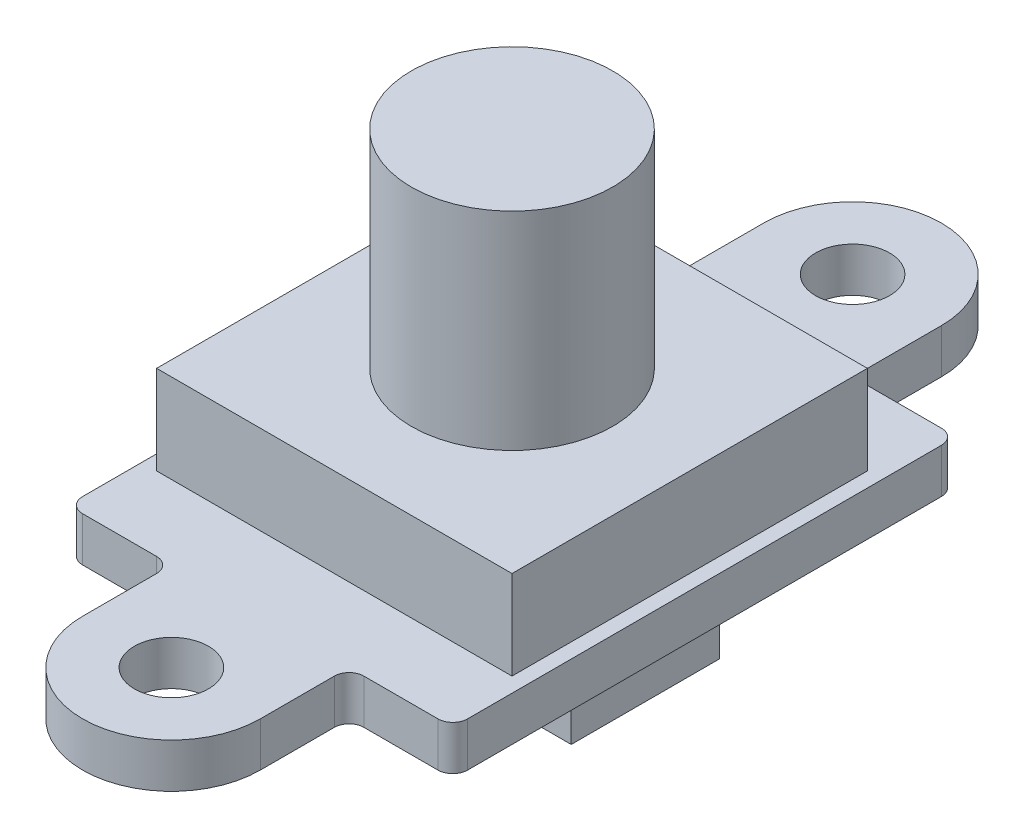
ISO-10303-21;
HEADER;
FILE_DESCRIPTION(('STEP AP214'),'2;1');
FILE_NAME('part.step','',(''),(''),'','','');
FILE_SCHEMA(('AUTOMOTIVE_DESIGN { 1 0 10303 214 1 1 1 1 }'));
ENDSEC;
DATA;
#1=APPLICATION_CONTEXT('core data for automotive mechanical design processes');
#2=APPLICATION_PROTOCOL_DEFINITION('international standard','automotive_design',2000,#1);
#3=PRODUCT_CONTEXT('',#1,'mechanical');
#4=PRODUCT('Part','Part','',(#3));
#5=PRODUCT_RELATED_PRODUCT_CATEGORY('part','',(#4));
#6=PRODUCT_DEFINITION_FORMATION('','',#4);
#7=PRODUCT_DEFINITION_CONTEXT('part definition',#1,'design');
#8=PRODUCT_DEFINITION('design','',#6,#7);
#9=PRODUCT_DEFINITION_SHAPE('','',#8);
#10=(LENGTH_UNIT() NAMED_UNIT(*) SI_UNIT(.MILLI.,.METRE.));
#11=(NAMED_UNIT(*) PLANE_ANGLE_UNIT() SI_UNIT($,.RADIAN.));
#12=(NAMED_UNIT(*) SI_UNIT($,.STERADIAN.) SOLID_ANGLE_UNIT());
#13=UNCERTAINTY_MEASURE_WITH_UNIT(LENGTH_MEASURE(1.E-05),#10,'distance_accuracy_value','');
#14=(GEOMETRIC_REPRESENTATION_CONTEXT(3) GLOBAL_UNCERTAINTY_ASSIGNED_CONTEXT((#13)) GLOBAL_UNIT_ASSIGNED_CONTEXT((#10,
#11,#12)) REPRESENTATION_CONTEXT('',''));
#15=CARTESIAN_POINT('',(0.,0.,0.));
#16=DIRECTION('',(0.,0.,1.));
#17=DIRECTION('',(1.,0.,0.));
#18=AXIS2_PLACEMENT_3D('',#15,#16,#17);
#19=CARTESIAN_POINT('',(0.,1.5,0.));
#20=DIRECTION('',(0.,1.,0.));
#21=DIRECTION('',(0.,0.,1.));
#22=AXIS2_PLACEMENT_3D('',#19,#20,#21);
#23=PLANE('',#22);
#24=DIRECTION('',(1.,0.,0.));
#25=VECTOR('',#24,1.);
#26=CARTESIAN_POINT('',(0.,1.5,-8.5));
#27=LINE('',#26,#25);
#28=CARTESIAN_POINT('',(-6.00000000000001,1.5,-8.5));
#29=VERTEX_POINT('',#28);
#30=CARTESIAN_POINT('',(-3.5,1.5,-8.5));
#31=VERTEX_POINT('',#30);
#32=EDGE_CURVE('E315',#29,#31,#27,.T.);
#33=ORIENTED_EDGE('',*,*,#32,.F.);
#34=CARTESIAN_POINT('',(-6.00000000000001,1.5,-8.));
#35=DIRECTION('',(0.,1.,0.));
#36=DIRECTION('',(0.,0.,1.));
#37=AXIS2_PLACEMENT_3D('',#34,#35,#36);
#38=CIRCLE('',#37,0.5);
#39=CARTESIAN_POINT('',(-6.50000000000001,1.5,-8.));
#40=VERTEX_POINT('',#39);
#41=EDGE_CURVE('E409',#29,#40,#38,.T.);
#42=ORIENTED_EDGE('',*,*,#41,.T.);
#43=DIRECTION('',(0.,0.,1.));
#44=VECTOR('',#43,1.);
#45=CARTESIAN_POINT('',(-6.50000000000001,1.5,0.));
#46=LINE('',#45,#44);
#47=CARTESIAN_POINT('',(-6.5,1.5,8.));
#48=VERTEX_POINT('',#47);
#49=EDGE_CURVE('E318',#40,#48,#46,.T.);
#50=ORIENTED_EDGE('',*,*,#49,.T.);
#51=CARTESIAN_POINT('',(-6.,1.5,8.));
#52=DIRECTION('',(0.,1.,0.));
#53=DIRECTION('',(0.,0.,1.));
#54=AXIS2_PLACEMENT_3D('',#51,#52,#53);
#55=CIRCLE('',#54,0.5);
#56=CARTESIAN_POINT('',(-6.,1.5,8.5));
#57=VERTEX_POINT('',#56);
#58=EDGE_CURVE('E61',#48,#57,#55,.T.);
#59=ORIENTED_EDGE('',*,*,#58,.T.);
#60=DIRECTION('',(1.,0.,0.));
#61=VECTOR('',#60,1.);
#62=CARTESIAN_POINT('',(0.,1.5,8.5));
#63=LINE('',#62,#61);
#64=CARTESIAN_POINT('',(-3.5,1.5,8.5));
#65=VERTEX_POINT('',#64);
#66=EDGE_CURVE('E320',#57,#65,#63,.T.);
#67=ORIENTED_EDGE('',*,*,#66,.T.);
#68=CARTESIAN_POINT('',(-3.5,1.5,9.));
#69=DIRECTION('',(0.,1.,0.));
#70=DIRECTION('',(0.,0.,1.));
#71=AXIS2_PLACEMENT_3D('',#68,#69,#70);
#72=CIRCLE('',#71,0.5);
#73=CARTESIAN_POINT('',(-3.,1.5,9.));
#74=VERTEX_POINT('',#73);
#75=EDGE_CURVE('E440',#65,#74,#72,.F.);
#76=ORIENTED_EDGE('',*,*,#75,.T.);
#77=DIRECTION('',(0.,0.,-1.));
#78=VECTOR('',#77,1.);
#79=CARTESIAN_POINT('',(-3.,1.5,0.));
#80=LINE('',#79,#78);
#81=CARTESIAN_POINT('',(-3.,1.5,11.5));
#82=VERTEX_POINT('',#81);
#83=EDGE_CURVE('E289',#82,#74,#80,.T.);
#84=ORIENTED_EDGE('',*,*,#83,.F.);
#85=CARTESIAN_POINT('',(0.,1.5,11.5));
#86=DIRECTION('',(0.,1.,0.));
#87=DIRECTION('',(0.,0.,1.));
#88=AXIS2_PLACEMENT_3D('',#85,#86,#87);
#89=CIRCLE('',#88,3.);
#90=CARTESIAN_POINT('',(3.,1.5,11.5));
#91=VERTEX_POINT('',#90);
#92=EDGE_CURVE('E292',#82,#91,#89,.T.);
#93=ORIENTED_EDGE('',*,*,#92,.T.);
#94=DIRECTION('',(0.,0.,-1.));
#95=VECTOR('',#94,1.);
#96=CARTESIAN_POINT('',(3.,1.5,0.));
#97=LINE('',#96,#95);
#98=CARTESIAN_POINT('',(3.,1.5,9.));
#99=VERTEX_POINT('',#98);
#100=EDGE_CURVE('E295',#91,#99,#97,.T.);
#101=ORIENTED_EDGE('',*,*,#100,.T.);
#102=CARTESIAN_POINT('',(3.5,1.5,9.));
#103=DIRECTION('',(0.,1.,0.));
#104=DIRECTION('',(0.,0.,1.));
#105=AXIS2_PLACEMENT_3D('',#102,#103,#104);
#106=CIRCLE('',#105,0.5);
#107=CARTESIAN_POINT('',(3.5,1.5,8.5));
#108=VERTEX_POINT('',#107);
#109=EDGE_CURVE('E11',#99,#108,#106,.F.);
#110=ORIENTED_EDGE('',*,*,#109,.T.);
#111=DIRECTION('',(1.,0.,0.));
#112=VECTOR('',#111,1.);
#113=CARTESIAN_POINT('',(0.,1.5,8.5));
#114=LINE('',#113,#112);
#115=CARTESIAN_POINT('',(6.,1.5,8.5));
#116=VERTEX_POINT('',#115);
#117=EDGE_CURVE('E298',#108,#116,#114,.T.);
#118=ORIENTED_EDGE('',*,*,#117,.T.);
#119=CARTESIAN_POINT('',(6.,1.5,8.));
#120=DIRECTION('',(0.,1.,0.));
#121=DIRECTION('',(0.,0.,1.));
#122=AXIS2_PLACEMENT_3D('',#119,#120,#121);
#123=CIRCLE('',#122,0.5);
#124=CARTESIAN_POINT('',(6.5,1.5,8.));
#125=VERTEX_POINT('',#124);
#126=EDGE_CURVE('E404',#116,#125,#123,.T.);
#127=ORIENTED_EDGE('',*,*,#126,.T.);
#128=DIRECTION('',(0.,0.,1.));
#129=VECTOR('',#128,1.);
#130=CARTESIAN_POINT('',(6.5,1.5,0.));
#131=LINE('',#130,#129);
#132=CARTESIAN_POINT('',(6.5,1.5,-8.));
#133=VERTEX_POINT('',#132);
#134=EDGE_CURVE('E301',#133,#125,#131,.T.);
#135=ORIENTED_EDGE('',*,*,#134,.F.);
#136=CARTESIAN_POINT('',(6.,1.5,-8.));
#137=DIRECTION('',(0.,1.,0.));
#138=DIRECTION('',(0.,0.,1.));
#139=AXIS2_PLACEMENT_3D('',#136,#137,#138);
#140=CIRCLE('',#139,0.5);
#141=CARTESIAN_POINT('',(6.,1.5,-8.5));
#142=VERTEX_POINT('',#141);
#143=EDGE_CURVE('E406',#133,#142,#140,.T.);
#144=ORIENTED_EDGE('',*,*,#143,.T.);
#145=DIRECTION('',(1.,0.,0.));
#146=VECTOR('',#145,1.);
#147=CARTESIAN_POINT('',(0.,1.5,-8.5));
#148=LINE('',#147,#146);
#149=CARTESIAN_POINT('',(3.5,1.5,-8.5));
#150=VERTEX_POINT('',#149);
#151=EDGE_CURVE('E304',#150,#142,#148,.T.);
#152=ORIENTED_EDGE('',*,*,#151,.F.);
#153=CARTESIAN_POINT('',(3.5,1.5,-9.));
#154=DIRECTION('',(0.,1.,0.));
#155=DIRECTION('',(0.,0.,1.));
#156=AXIS2_PLACEMENT_3D('',#153,#154,#155);
#157=CIRCLE('',#156,0.5);
#158=CARTESIAN_POINT('',(3.,1.5,-9.));
#159=VERTEX_POINT('',#158);
#160=EDGE_CURVE('E436',#150,#159,#157,.F.);
#161=ORIENTED_EDGE('',*,*,#160,.T.);
#162=DIRECTION('',(0.,0.,1.));
#163=VECTOR('',#162,1.);
#164=CARTESIAN_POINT('',(3.,1.5,0.));
#165=LINE('',#164,#163);
#166=CARTESIAN_POINT('',(3.,1.5,-11.5));
#167=VERTEX_POINT('',#166);
#168=EDGE_CURVE('E307',#167,#159,#165,.T.);
#169=ORIENTED_EDGE('',*,*,#168,.F.);
#170=CARTESIAN_POINT('',(0.,1.5,-11.5));
#171=DIRECTION('',(0.,1.,0.));
#172=DIRECTION('',(0.,0.,1.));
#173=AXIS2_PLACEMENT_3D('',#170,#171,#172);
#174=CIRCLE('',#173,3.);
#175=CARTESIAN_POINT('',(-3.,1.5,-11.5));
#176=VERTEX_POINT('',#175);
#177=EDGE_CURVE('E310',#167,#176,#174,.T.);
#178=ORIENTED_EDGE('',*,*,#177,.T.);
#179=DIRECTION('',(0.,0.,1.));
#180=VECTOR('',#179,1.);
#181=CARTESIAN_POINT('',(-3.,1.5,0.));
#182=LINE('',#181,#180);
#183=CARTESIAN_POINT('',(-3.,1.5,-9.));
#184=VERTEX_POINT('',#183);
#185=EDGE_CURVE('E312',#176,#184,#182,.T.);
#186=ORIENTED_EDGE('',*,*,#185,.T.);
#187=CARTESIAN_POINT('',(-3.5,1.5,-9.));
#188=DIRECTION('',(0.,1.,0.));
#189=DIRECTION('',(0.,0.,1.));
#190=AXIS2_PLACEMENT_3D('',#187,#188,#189);
#191=CIRCLE('',#190,0.5);
#192=EDGE_CURVE('E432',#184,#31,#191,.F.);
#193=ORIENTED_EDGE('',*,*,#192,.T.);
#194=EDGE_LOOP('',(#33,#42,#50,#59,#67,#76,#84,#93,#101,#110,#118,#127,#135,#144,#152,#161,#169,
#178,#186,#193));
#195=FACE_BOUND('',#194,.T.);
#196=CARTESIAN_POINT('',(0.,1.5,-11.5));
#197=DIRECTION('',(0.,1.,0.));
#198=DIRECTION('',(0.,0.,1.));
#199=AXIS2_PLACEMENT_3D('',#196,#197,#198);
#200=CIRCLE('',#199,1.25);
#201=CARTESIAN_POINT('',(0.,1.5,-10.25));
#202=VERTEX_POINT('',#201);
#203=EDGE_CURVE('E322',#202,#202,#200,.T.);
#204=ORIENTED_EDGE('',*,*,#203,.F.);
#205=EDGE_LOOP('',(#204));
#206=FACE_BOUND('',#205,.T.);
#207=CARTESIAN_POINT('',(0.,1.5,11.5));
#208=DIRECTION('',(0.,1.,0.));
#209=DIRECTION('',(0.,0.,1.));
#210=AXIS2_PLACEMENT_3D('',#207,#208,#209);
#211=CIRCLE('',#210,1.25);
#212=CARTESIAN_POINT('',(0.,1.5,12.75));
#213=VERTEX_POINT('',#212);
#214=EDGE_CURVE('E325',#213,#213,#211,.T.);
#215=ORIENTED_EDGE('',*,*,#214,.F.);
#216=EDGE_LOOP('',(#215));
#217=FACE_BOUND('',#216,.T.);
#218=DIRECTION('',(-1.,0.,0.));
#219=VECTOR('',#218,1.);
#220=CARTESIAN_POINT('',(-6.,1.5,-6.));
#221=LINE('',#220,#219);
#222=CARTESIAN_POINT('',(6.,1.5,-6.));
#223=VERTEX_POINT('',#222);
#224=CARTESIAN_POINT('',(-6.,1.5,-6.));
#225=VERTEX_POINT('',#224);
#226=EDGE_CURVE('E958',#223,#225,#221,.T.);
#227=ORIENTED_EDGE('',*,*,#226,.F.);
#228=DIRECTION('',(0.,0.,-1.));
#229=VECTOR('',#228,1.);
#230=CARTESIAN_POINT('',(6.,1.5,-6.));
#231=LINE('',#230,#229);
#232=CARTESIAN_POINT('',(6.,1.5,6.));
#233=VERTEX_POINT('',#232);
#234=EDGE_CURVE('E248',#233,#223,#231,.T.);
#235=ORIENTED_EDGE('',*,*,#234,.F.);
#236=DIRECTION('',(1.,0.,0.));
#237=VECTOR('',#236,1.);
#238=CARTESIAN_POINT('',(-6.,1.5,6.));
#239=LINE('',#238,#237);
#240=CARTESIAN_POINT('',(-6.,1.5,6.));
#241=VERTEX_POINT('',#240);
#242=EDGE_CURVE('E244',#241,#233,#239,.T.);
#243=ORIENTED_EDGE('',*,*,#242,.F.);
#244=DIRECTION('',(0.,0.,1.));
#245=VECTOR('',#244,1.);
#246=CARTESIAN_POINT('',(-6.,1.5,-6.));
#247=LINE('',#246,#245);
#248=EDGE_CURVE('E967',#225,#241,#247,.T.);
#249=ORIENTED_EDGE('',*,*,#248,.F.);
#250=EDGE_LOOP('',(#227,#235,#243,#249));
#251=FACE_BOUND('',#250,.T.);
#252=ADVANCED_FACE('F39',(#195,#206,#217,#251),#23,.T.);
#253=CARTESIAN_POINT('',(0.,0.,0.));
#254=DIRECTION('',(0.,1.,0.));
#255=DIRECTION('',(0.,0.,1.));
#256=AXIS2_PLACEMENT_3D('',#253,#254,#255);
#257=PLANE('',#256);
#258=CARTESIAN_POINT('',(0.,0.,11.5));
#259=DIRECTION('',(0.,1.,0.));
#260=DIRECTION('',(0.,0.,1.));
#261=AXIS2_PLACEMENT_3D('',#258,#259,#260);
#262=CIRCLE('',#261,1.25);
#263=CARTESIAN_POINT('',(0.,0.,12.75));
#264=VERTEX_POINT('',#263);
#265=EDGE_CURVE('E293',#264,#264,#262,.T.);
#266=ORIENTED_EDGE('',*,*,#265,.T.);
#267=EDGE_LOOP('',(#266));
#268=FACE_BOUND('',#267,.T.);
#269=CARTESIAN_POINT('',(0.,0.,-11.5));
#270=DIRECTION('',(0.,1.,0.));
#271=DIRECTION('',(0.,0.,1.));
#272=AXIS2_PLACEMENT_3D('',#269,#270,#271);
#273=CIRCLE('',#272,1.25);
#274=CARTESIAN_POINT('',(0.,0.,-10.25));
#275=VERTEX_POINT('',#274);
#276=EDGE_CURVE('E361',#275,#275,#273,.T.);
#277=ORIENTED_EDGE('',*,*,#276,.T.);
#278=EDGE_LOOP('',(#277));
#279=FACE_BOUND('',#278,.T.);
#280=DIRECTION('',(0.,0.,1.));
#281=VECTOR('',#280,1.);
#282=CARTESIAN_POINT('',(-6.50000000000001,0.,0.));
#283=LINE('',#282,#281);
#284=CARTESIAN_POINT('',(-6.50000000000001,0.,-8.));
#285=VERTEX_POINT('',#284);
#286=CARTESIAN_POINT('',(-6.5,0.,8.));
#287=VERTEX_POINT('',#286);
#288=EDGE_CURVE('E356',#285,#287,#283,.T.);
#289=ORIENTED_EDGE('',*,*,#288,.F.);
#290=CARTESIAN_POINT('',(-6.00000000000001,0.,-8.));
#291=DIRECTION('',(0.,1.,0.));
#292=DIRECTION('',(0.,0.,1.));
#293=AXIS2_PLACEMENT_3D('',#290,#291,#292);
#294=CIRCLE('',#293,0.5);
#295=CARTESIAN_POINT('',(-6.00000000000001,0.,-8.5));
#296=VERTEX_POINT('',#295);
#297=EDGE_CURVE('E402',#285,#296,#294,.F.);
#298=ORIENTED_EDGE('',*,*,#297,.T.);
#299=DIRECTION('',(1.,0.,0.));
#300=VECTOR('',#299,1.);
#301=CARTESIAN_POINT('',(0.,0.,-8.5));
#302=LINE('',#301,#300);
#303=CARTESIAN_POINT('',(-3.5,0.,-8.5));
#304=VERTEX_POINT('',#303);
#305=EDGE_CURVE('E353',#296,#304,#302,.T.);
#306=ORIENTED_EDGE('',*,*,#305,.T.);
#307=CARTESIAN_POINT('',(-3.5,0.,-9.));
#308=DIRECTION('',(0.,1.,0.));
#309=DIRECTION('',(0.,0.,1.));
#310=AXIS2_PLACEMENT_3D('',#307,#308,#309);
#311=CIRCLE('',#310,0.5);
#312=CARTESIAN_POINT('',(-3.,0.,-9.));
#313=VERTEX_POINT('',#312);
#314=EDGE_CURVE('E430',#304,#313,#311,.T.);
#315=ORIENTED_EDGE('',*,*,#314,.T.);
#316=DIRECTION('',(0.,0.,1.));
#317=VECTOR('',#316,1.);
#318=CARTESIAN_POINT('',(-3.,0.,0.));
#319=LINE('',#318,#317);
#320=CARTESIAN_POINT('',(-3.,0.,-11.5));
#321=VERTEX_POINT('',#320);
#322=EDGE_CURVE('E350',#321,#313,#319,.T.);
#323=ORIENTED_EDGE('',*,*,#322,.F.);
#324=CARTESIAN_POINT('',(0.,0.,-11.5));
#325=DIRECTION('',(0.,1.,0.));
#326=DIRECTION('',(0.,0.,1.));
#327=AXIS2_PLACEMENT_3D('',#324,#325,#326);
#328=CIRCLE('',#327,3.);
#329=CARTESIAN_POINT('',(3.,0.,-11.5));
#330=VERTEX_POINT('',#329);
#331=EDGE_CURVE('E348',#330,#321,#328,.T.);
#332=ORIENTED_EDGE('',*,*,#331,.F.);
#333=DIRECTION('',(0.,0.,1.));
#334=VECTOR('',#333,1.);
#335=CARTESIAN_POINT('',(3.,0.,0.));
#336=LINE('',#335,#334);
#337=CARTESIAN_POINT('',(3.,0.,-9.));
#338=VERTEX_POINT('',#337);
#339=EDGE_CURVE('E345',#330,#338,#336,.T.);
#340=ORIENTED_EDGE('',*,*,#339,.T.);
#341=CARTESIAN_POINT('',(3.5,0.,-9.));
#342=DIRECTION('',(0.,1.,0.));
#343=DIRECTION('',(0.,0.,1.));
#344=AXIS2_PLACEMENT_3D('',#341,#342,#343);
#345=CIRCLE('',#344,0.5);
#346=CARTESIAN_POINT('',(3.5,0.,-8.5));
#347=VERTEX_POINT('',#346);
#348=EDGE_CURVE('E434',#338,#347,#345,.T.);
#349=ORIENTED_EDGE('',*,*,#348,.T.);
#350=DIRECTION('',(1.,0.,0.));
#351=VECTOR('',#350,1.);
#352=CARTESIAN_POINT('',(0.,0.,-8.5));
#353=LINE('',#352,#351);
#354=CARTESIAN_POINT('',(6.,0.,-8.5));
#355=VERTEX_POINT('',#354);
#356=EDGE_CURVE('E342',#347,#355,#353,.T.);
#357=ORIENTED_EDGE('',*,*,#356,.T.);
#358=CARTESIAN_POINT('',(6.,0.,-8.));
#359=DIRECTION('',(0.,1.,0.));
#360=DIRECTION('',(0.,0.,1.));
#361=AXIS2_PLACEMENT_3D('',#358,#359,#360);
#362=CIRCLE('',#361,0.5);
#363=CARTESIAN_POINT('',(6.5,0.,-8.));
#364=VERTEX_POINT('',#363);
#365=EDGE_CURVE('E398',#355,#364,#362,.F.);
#366=ORIENTED_EDGE('',*,*,#365,.T.);
#367=DIRECTION('',(0.,0.,1.));
#368=VECTOR('',#367,1.);
#369=CARTESIAN_POINT('',(6.5,0.,0.));
#370=LINE('',#369,#368);
#371=CARTESIAN_POINT('',(6.5,0.,8.));
#372=VERTEX_POINT('',#371);
#373=EDGE_CURVE('E339',#364,#372,#370,.T.);
#374=ORIENTED_EDGE('',*,*,#373,.T.);
#375=CARTESIAN_POINT('',(6.,0.,8.));
#376=DIRECTION('',(0.,1.,0.));
#377=DIRECTION('',(0.,0.,1.));
#378=AXIS2_PLACEMENT_3D('',#375,#376,#377);
#379=CIRCLE('',#378,0.5);
#380=CARTESIAN_POINT('',(6.,0.,8.5));
#381=VERTEX_POINT('',#380);
#382=EDGE_CURVE('E396',#372,#381,#379,.F.);
#383=ORIENTED_EDGE('',*,*,#382,.T.);
#384=DIRECTION('',(1.,0.,0.));
#385=VECTOR('',#384,1.);
#386=CARTESIAN_POINT('',(0.,0.,8.5));
#387=LINE('',#386,#385);
#388=CARTESIAN_POINT('',(3.5,0.,8.5));
#389=VERTEX_POINT('',#388);
#390=EDGE_CURVE('E336',#389,#381,#387,.T.);
#391=ORIENTED_EDGE('',*,*,#390,.F.);
#392=CARTESIAN_POINT('',(3.5,0.,9.));
#393=DIRECTION('',(0.,1.,0.));
#394=DIRECTION('',(0.,0.,1.));
#395=AXIS2_PLACEMENT_3D('',#392,#393,#394);
#396=CIRCLE('',#395,0.5);
#397=CARTESIAN_POINT('',(3.,0.,9.));
#398=VERTEX_POINT('',#397);
#399=EDGE_CURVE('E47',#389,#398,#396,.T.);
#400=ORIENTED_EDGE('',*,*,#399,.T.);
#401=DIRECTION('',(0.,0.,-1.));
#402=VECTOR('',#401,1.);
#403=CARTESIAN_POINT('',(3.,0.,0.));
#404=LINE('',#403,#402);
#405=CARTESIAN_POINT('',(3.,0.,11.5));
#406=VERTEX_POINT('',#405);
#407=EDGE_CURVE('E333',#406,#398,#404,.T.);
#408=ORIENTED_EDGE('',*,*,#407,.F.);
#409=CARTESIAN_POINT('',(0.,0.,11.5));
#410=DIRECTION('',(0.,1.,0.));
#411=DIRECTION('',(0.,0.,1.));
#412=AXIS2_PLACEMENT_3D('',#409,#410,#411);
#413=CIRCLE('',#412,3.);
#414=CARTESIAN_POINT('',(-3.,0.,11.5));
#415=VERTEX_POINT('',#414);
#416=EDGE_CURVE('E331',#415,#406,#413,.T.);
#417=ORIENTED_EDGE('',*,*,#416,.F.);
#418=DIRECTION('',(0.,0.,-1.));
#419=VECTOR('',#418,1.);
#420=CARTESIAN_POINT('',(-3.,0.,0.));
#421=LINE('',#420,#419);
#422=CARTESIAN_POINT('',(-3.,0.,9.));
#423=VERTEX_POINT('',#422);
#424=EDGE_CURVE('E288',#415,#423,#421,.T.);
#425=ORIENTED_EDGE('',*,*,#424,.T.);
#426=CARTESIAN_POINT('',(-3.5,0.,9.));
#427=DIRECTION('',(0.,1.,0.));
#428=DIRECTION('',(0.,0.,1.));
#429=AXIS2_PLACEMENT_3D('',#426,#427,#428);
#430=CIRCLE('',#429,0.5);
#431=CARTESIAN_POINT('',(-3.5,0.,8.5));
#432=VERTEX_POINT('',#431);
#433=EDGE_CURVE('E438',#423,#432,#430,.T.);
#434=ORIENTED_EDGE('',*,*,#433,.T.);
#435=DIRECTION('',(1.,0.,0.));
#436=VECTOR('',#435,1.);
#437=CARTESIAN_POINT('',(0.,0.,8.5));
#438=LINE('',#437,#436);
#439=CARTESIAN_POINT('',(-6.,0.,8.5));
#440=VERTEX_POINT('',#439);
#441=EDGE_CURVE('E359',#440,#432,#438,.T.);
#442=ORIENTED_EDGE('',*,*,#441,.F.);
#443=CARTESIAN_POINT('',(-6.,0.,8.));
#444=DIRECTION('',(0.,1.,0.));
#445=DIRECTION('',(0.,0.,1.));
#446=AXIS2_PLACEMENT_3D('',#443,#444,#445);
#447=CIRCLE('',#446,0.5);
#448=EDGE_CURVE('E400',#440,#287,#447,.F.);
#449=ORIENTED_EDGE('',*,*,#448,.T.);
#450=EDGE_LOOP('',(#289,#298,#306,#315,#323,#332,#340,#349,#357,#366,#374,#383,#391,#400,#408,
#417,#425,#434,#442,#449));
#451=FACE_BOUND('',#450,.T.);
#452=DIRECTION('',(0.,0.,1.));
#453=VECTOR('',#452,1.);
#454=CARTESIAN_POINT('',(4.5,0.,2.5));
#455=LINE('',#454,#453);
#456=CARTESIAN_POINT('',(4.5,0.,-2.5));
#457=VERTEX_POINT('',#456);
#458=CARTESIAN_POINT('',(4.5,0.,2.5));
#459=VERTEX_POINT('',#458);
#460=EDGE_CURVE('E250',#457,#459,#455,.T.);
#461=ORIENTED_EDGE('',*,*,#460,.F.);
#462=DIRECTION('',(1.,0.,0.));
#463=VECTOR('',#462,1.);
#464=CARTESIAN_POINT('',(4.5,0.,-2.5));
#465=LINE('',#464,#463);
#466=CARTESIAN_POINT('',(-0.500000000000002,0.,-2.50000000000001));
#467=VERTEX_POINT('',#466);
#468=EDGE_CURVE('E263',#467,#457,#465,.T.);
#469=ORIENTED_EDGE('',*,*,#468,.F.);
#470=DIRECTION('',(0.,0.,-1.));
#471=VECTOR('',#470,1.);
#472=CARTESIAN_POINT('',(-0.500000000000004,0.,2.5));
#473=LINE('',#472,#471);
#474=CARTESIAN_POINT('',(-0.500000000000004,0.,2.5));
#475=VERTEX_POINT('',#474);
#476=EDGE_CURVE('E272',#475,#467,#473,.T.);
#477=ORIENTED_EDGE('',*,*,#476,.F.);
#478=DIRECTION('',(-1.,0.,0.));
#479=VECTOR('',#478,1.);
#480=CARTESIAN_POINT('',(4.5,0.,2.5));
#481=LINE('',#480,#479);
#482=EDGE_CURVE('E253',#459,#475,#481,.T.);
#483=ORIENTED_EDGE('',*,*,#482,.F.);
#484=EDGE_LOOP('',(#461,#469,#477,#483));
#485=FACE_BOUND('',#484,.T.);
#486=ADVANCED_FACE('F445',(#268,#279,#451,#485),#257,.F.);
#487=CARTESIAN_POINT('',(-3.,1.5,0.));
#488=DIRECTION('',(-1.,0.,0.));
#489=DIRECTION('',(0.,0.,1.));
#490=AXIS2_PLACEMENT_3D('',#487,#488,#489);
#491=PLANE('',#490);
#492=ORIENTED_EDGE('',*,*,#83,.T.);
#493=DIRECTION('',(0.,-1.,0.));
#494=VECTOR('',#493,1.);
#495=CARTESIAN_POINT('',(-3.,1.5,9.));
#496=LINE('',#495,#494);
#497=EDGE_CURVE('E411',#74,#423,#496,.T.);
#498=ORIENTED_EDGE('',*,*,#497,.T.);
#499=ORIENTED_EDGE('',*,*,#424,.F.);
#500=DIRECTION('',(0.,-1.,0.));
#501=VECTOR('',#500,1.);
#502=CARTESIAN_POINT('',(-3.,1.5,11.5));
#503=LINE('',#502,#501);
#504=EDGE_CURVE('E373',#82,#415,#503,.T.);
#505=ORIENTED_EDGE('',*,*,#504,.F.);
#506=EDGE_LOOP('',(#492,#498,#499,#505));
#507=FACE_BOUND('',#506,.T.);
#508=ADVANCED_FACE('F524',(#507),#491,.T.);
#509=CARTESIAN_POINT('',(0.,1.5,11.5));
#510=DIRECTION('',(0.,-1.,0.));
#511=DIRECTION('',(0.,0.,-1.));
#512=AXIS2_PLACEMENT_3D('',#509,#510,#511);
#513=CYLINDRICAL_SURFACE('',#512,3.);
#514=ORIENTED_EDGE('',*,*,#416,.T.);
#515=DIRECTION('',(0.,-1.,0.));
#516=VECTOR('',#515,1.);
#517=CARTESIAN_POINT('',(3.,1.5,11.5));
#518=LINE('',#517,#516);
#519=EDGE_CURVE('E370',#91,#406,#518,.T.);
#520=ORIENTED_EDGE('',*,*,#519,.F.);
#521=ORIENTED_EDGE('',*,*,#92,.F.);
#522=ORIENTED_EDGE('',*,*,#504,.T.);
#523=EDGE_LOOP('',(#514,#520,#521,#522));
#524=FACE_BOUND('',#523,.T.);
#525=ADVANCED_FACE('F528',(#524),#513,.T.);
#526=CARTESIAN_POINT('',(3.,1.5,0.));
#527=DIRECTION('',(-1.,0.,0.));
#528=DIRECTION('',(0.,0.,1.));
#529=AXIS2_PLACEMENT_3D('',#526,#527,#528);
#530=PLANE('',#529);
#531=ORIENTED_EDGE('',*,*,#407,.T.);
#532=DIRECTION('',(0.,-1.,0.));
#533=VECTOR('',#532,1.);
#534=CARTESIAN_POINT('',(3.,1.5,9.));
#535=LINE('',#534,#533);
#536=EDGE_CURVE('E423',#398,#99,#535,.F.);
#537=ORIENTED_EDGE('',*,*,#536,.T.);
#538=ORIENTED_EDGE('',*,*,#100,.F.);
#539=ORIENTED_EDGE('',*,*,#519,.T.);
#540=EDGE_LOOP('',(#531,#537,#538,#539));
#541=FACE_BOUND('',#540,.T.);
#542=ADVANCED_FACE('F452',(#541),#530,.F.);
#543=CARTESIAN_POINT('',(0.,1.5,8.5));
#544=DIRECTION('',(0.,0.,-1.));
#545=DIRECTION('',(-1.,0.,0.));
#546=AXIS2_PLACEMENT_3D('',#543,#544,#545);
#547=PLANE('',#546);
#548=ORIENTED_EDGE('',*,*,#117,.F.);
#549=DIRECTION('',(0.,-1.,0.));
#550=VECTOR('',#549,1.);
#551=CARTESIAN_POINT('',(3.5,0.,8.5));
#552=LINE('',#551,#550);
#553=EDGE_CURVE('E420',#108,#389,#552,.T.);
#554=ORIENTED_EDGE('',*,*,#553,.T.);
#555=ORIENTED_EDGE('',*,*,#390,.T.);
#556=DIRECTION('',(0.,-1.,0.));
#557=VECTOR('',#556,1.);
#558=CARTESIAN_POINT('',(6.,1.5,8.5));
#559=LINE('',#558,#557);
#560=EDGE_CURVE('E418',#381,#116,#559,.F.);
#561=ORIENTED_EDGE('',*,*,#560,.T.);
#562=EDGE_LOOP('',(#548,#554,#555,#561));
#563=FACE_BOUND('',#562,.T.);
#564=ADVANCED_FACE('F462',(#563),#547,.F.);
#565=CARTESIAN_POINT('',(6.5,1.5,0.));
#566=DIRECTION('',(1.,0.,0.));
#567=DIRECTION('',(0.,0.,-1.));
#568=AXIS2_PLACEMENT_3D('',#565,#566,#567);
#569=PLANE('',#568);
#570=ORIENTED_EDGE('',*,*,#373,.F.);
#571=DIRECTION('',(0.,-1.,0.));
#572=VECTOR('',#571,1.);
#573=CARTESIAN_POINT('',(6.5,1.5,-8.));
#574=LINE('',#573,#572);
#575=EDGE_CURVE('E428',#364,#133,#574,.F.);
#576=ORIENTED_EDGE('',*,*,#575,.T.);
#577=ORIENTED_EDGE('',*,*,#134,.T.);
#578=DIRECTION('',(0.,-1.,0.));
#579=VECTOR('',#578,1.);
#580=CARTESIAN_POINT('',(6.5,0.,8.));
#581=LINE('',#580,#579);
#582=EDGE_CURVE('E425',#125,#372,#581,.T.);
#583=ORIENTED_EDGE('',*,*,#582,.T.);
#584=EDGE_LOOP('',(#570,#576,#577,#583));
#585=FACE_BOUND('',#584,.T.);
#586=ADVANCED_FACE('F470',(#585),#569,.T.);
#587=CARTESIAN_POINT('',(0.,1.5,-8.5));
#588=DIRECTION('',(0.,0.,-1.));
#589=DIRECTION('',(-1.,0.,0.));
#590=AXIS2_PLACEMENT_3D('',#587,#588,#589);
#591=PLANE('',#590);
#592=ORIENTED_EDGE('',*,*,#356,.F.);
#593=DIRECTION('',(0.,-1.,0.));
#594=VECTOR('',#593,1.);
#595=CARTESIAN_POINT('',(3.5,1.5,-8.5));
#596=LINE('',#595,#594);
#597=EDGE_CURVE('E389',#347,#150,#596,.F.);
#598=ORIENTED_EDGE('',*,*,#597,.T.);
#599=ORIENTED_EDGE('',*,*,#151,.T.);
#600=DIRECTION('',(0.,-1.,0.));
#601=VECTOR('',#600,1.);
#602=CARTESIAN_POINT('',(6.,1.5,-8.5));
#603=LINE('',#602,#601);
#604=EDGE_CURVE('E386',#142,#355,#603,.T.);
#605=ORIENTED_EDGE('',*,*,#604,.T.);
#606=EDGE_LOOP('',(#592,#598,#599,#605));
#607=FACE_BOUND('',#606,.T.);
#608=ADVANCED_FACE('F479',(#607),#591,.T.);
#609=CARTESIAN_POINT('',(3.,1.5,0.));
#610=DIRECTION('',(1.,0.,0.));
#611=DIRECTION('',(0.,0.,-1.));
#612=AXIS2_PLACEMENT_3D('',#609,#610,#611);
#613=PLANE('',#612);
#614=ORIENTED_EDGE('',*,*,#168,.T.);
#615=DIRECTION('',(0.,-1.,0.));
#616=VECTOR('',#615,1.);
#617=CARTESIAN_POINT('',(3.,0.,-9.));
#618=LINE('',#617,#616);
#619=EDGE_CURVE('E383',#159,#338,#618,.T.);
#620=ORIENTED_EDGE('',*,*,#619,.T.);
#621=ORIENTED_EDGE('',*,*,#339,.F.);
#622=DIRECTION('',(0.,-1.,0.));
#623=VECTOR('',#622,1.);
#624=CARTESIAN_POINT('',(3.,1.5,-11.5));
#625=LINE('',#624,#623);
#626=EDGE_CURVE('E368',#167,#330,#625,.T.);
#627=ORIENTED_EDGE('',*,*,#626,.F.);
#628=EDGE_LOOP('',(#614,#620,#621,#627));
#629=FACE_BOUND('',#628,.T.);
#630=ADVANCED_FACE('F486',(#629),#613,.T.);
#631=CARTESIAN_POINT('',(0.,1.5,-11.5));
#632=DIRECTION('',(0.,-1.,0.));
#633=DIRECTION('',(0.,0.,-1.));
#634=AXIS2_PLACEMENT_3D('',#631,#632,#633);
#635=CYLINDRICAL_SURFACE('',#634,3.);
#636=ORIENTED_EDGE('',*,*,#331,.T.);
#637=DIRECTION('',(0.,-1.,0.));
#638=VECTOR('',#637,1.);
#639=CARTESIAN_POINT('',(-3.,1.5,-11.5));
#640=LINE('',#639,#638);
#641=EDGE_CURVE('E328',#176,#321,#640,.T.);
#642=ORIENTED_EDGE('',*,*,#641,.F.);
#643=ORIENTED_EDGE('',*,*,#177,.F.);
#644=ORIENTED_EDGE('',*,*,#626,.T.);
#645=EDGE_LOOP('',(#636,#642,#643,#644));
#646=FACE_BOUND('',#645,.T.);
#647=ADVANCED_FACE('F492',(#646),#635,.T.);
#648=CARTESIAN_POINT('',(-3.,1.5,0.));
#649=DIRECTION('',(1.,0.,0.));
#650=DIRECTION('',(0.,0.,-1.));
#651=AXIS2_PLACEMENT_3D('',#648,#649,#650);
#652=PLANE('',#651);
#653=ORIENTED_EDGE('',*,*,#322,.T.);
#654=DIRECTION('',(0.,-1.,0.));
#655=VECTOR('',#654,1.);
#656=CARTESIAN_POINT('',(-3.,1.5,-9.));
#657=LINE('',#656,#655);
#658=EDGE_CURVE('E381',#313,#184,#657,.F.);
#659=ORIENTED_EDGE('',*,*,#658,.T.);
#660=ORIENTED_EDGE('',*,*,#185,.F.);
#661=ORIENTED_EDGE('',*,*,#641,.T.);
#662=EDGE_LOOP('',(#653,#659,#660,#661));
#663=FACE_BOUND('',#662,.T.);
#664=ADVANCED_FACE('F562',(#663),#652,.F.);
#665=CARTESIAN_POINT('',(0.,1.5,-8.5));
#666=DIRECTION('',(0.,0.,-1.));
#667=DIRECTION('',(-1.,0.,0.));
#668=AXIS2_PLACEMENT_3D('',#665,#666,#667);
#669=PLANE('',#668);
#670=ORIENTED_EDGE('',*,*,#32,.T.);
#671=DIRECTION('',(0.,-1.,0.));
#672=VECTOR('',#671,1.);
#673=CARTESIAN_POINT('',(-3.5,1.5,-8.5));
#674=LINE('',#673,#672);
#675=EDGE_CURVE('E378',#31,#304,#674,.T.);
#676=ORIENTED_EDGE('',*,*,#675,.T.);
#677=ORIENTED_EDGE('',*,*,#305,.F.);
#678=DIRECTION('',(0.,-1.,0.));
#679=VECTOR('',#678,1.);
#680=CARTESIAN_POINT('',(-6.00000000000001,1.5,-8.5));
#681=LINE('',#680,#679);
#682=EDGE_CURVE('E376',#296,#29,#681,.F.);
#683=ORIENTED_EDGE('',*,*,#682,.T.);
#684=EDGE_LOOP('',(#670,#676,#677,#683));
#685=FACE_BOUND('',#684,.T.);
#686=ADVANCED_FACE('F502',(#685),#669,.T.);
#687=CARTESIAN_POINT('',(-6.50000000000001,1.5,0.));
#688=DIRECTION('',(1.,0.,0.));
#689=DIRECTION('',(0.,0.,-1.));
#690=AXIS2_PLACEMENT_3D('',#687,#688,#689);
#691=PLANE('',#690);
#692=ORIENTED_EDGE('',*,*,#49,.F.);
#693=DIRECTION('',(0.,-1.,0.));
#694=VECTOR('',#693,1.);
#695=CARTESIAN_POINT('',(-6.50000000000001,0.,-8.));
#696=LINE('',#695,#694);
#697=EDGE_CURVE('E393',#40,#285,#696,.T.);
#698=ORIENTED_EDGE('',*,*,#697,.T.);
#699=ORIENTED_EDGE('',*,*,#288,.T.);
#700=DIRECTION('',(0.,-1.,0.));
#701=VECTOR('',#700,1.);
#702=CARTESIAN_POINT('',(-6.5,1.5,8.));
#703=LINE('',#702,#701);
#704=EDGE_CURVE('E391',#287,#48,#703,.F.);
#705=ORIENTED_EDGE('',*,*,#704,.T.);
#706=EDGE_LOOP('',(#692,#698,#699,#705));
#707=FACE_BOUND('',#706,.T.);
#708=ADVANCED_FACE('F511',(#707),#691,.F.);
#709=CARTESIAN_POINT('',(0.,1.5,-11.5));
#710=DIRECTION('',(0.,-1.,0.));
#711=DIRECTION('',(0.,0.,-1.));
#712=AXIS2_PLACEMENT_3D('',#709,#710,#711);
#713=CYLINDRICAL_SURFACE('',#712,1.25);
#714=ORIENTED_EDGE('',*,*,#203,.T.);
#715=EDGE_LOOP('',(#714));
#716=FACE_BOUND('',#715,.T.);
#717=ORIENTED_EDGE('',*,*,#276,.F.);
#718=EDGE_LOOP('',(#717));
#719=FACE_BOUND('',#718,.T.);
#720=ADVANCED_FACE('F552',(#716,#719),#713,.F.);
#721=CARTESIAN_POINT('',(0.,1.5,8.5));
#722=DIRECTION('',(0.,0.,-1.));
#723=DIRECTION('',(-1.,0.,0.));
#724=AXIS2_PLACEMENT_3D('',#721,#722,#723);
#725=PLANE('',#724);
#726=ORIENTED_EDGE('',*,*,#441,.T.);
#727=DIRECTION('',(0.,-1.,0.));
#728=VECTOR('',#727,1.);
#729=CARTESIAN_POINT('',(-3.5,1.5,8.5));
#730=LINE('',#729,#728);
#731=EDGE_CURVE('E54',#432,#65,#730,.F.);
#732=ORIENTED_EDGE('',*,*,#731,.T.);
#733=ORIENTED_EDGE('',*,*,#66,.F.);
#734=DIRECTION('',(0.,-1.,0.));
#735=VECTOR('',#734,1.);
#736=CARTESIAN_POINT('',(-6.,1.5,8.5));
#737=LINE('',#736,#735);
#738=EDGE_CURVE('E414',#57,#440,#737,.T.);
#739=ORIENTED_EDGE('',*,*,#738,.T.);
#740=EDGE_LOOP('',(#726,#732,#733,#739));
#741=FACE_BOUND('',#740,.T.);
#742=ADVANCED_FACE('F517',(#741),#725,.F.);
#743=CARTESIAN_POINT('',(0.,1.5,11.5));
#744=DIRECTION('',(0.,-1.,0.));
#745=DIRECTION('',(0.,0.,-1.));
#746=AXIS2_PLACEMENT_3D('',#743,#744,#745);
#747=CYLINDRICAL_SURFACE('',#746,1.25);
#748=ORIENTED_EDGE('',*,*,#214,.T.);
#749=EDGE_LOOP('',(#748));
#750=FACE_BOUND('',#749,.T.);
#751=ORIENTED_EDGE('',*,*,#265,.F.);
#752=EDGE_LOOP('',(#751));
#753=FACE_BOUND('',#752,.T.);
#754=ADVANCED_FACE('F548',(#750,#753),#747,.F.);
#755=CARTESIAN_POINT('',(4.5,-3.,2.5));
#756=DIRECTION('',(-1.,0.,0.));
#757=DIRECTION('',(0.,0.,1.));
#758=AXIS2_PLACEMENT_3D('',#755,#756,#757);
#759=PLANE('',#758);
#760=ORIENTED_EDGE('',*,*,#460,.T.);
#761=DIRECTION('',(0.,1.,0.));
#762=VECTOR('',#761,1.);
#763=CARTESIAN_POINT('',(4.5,-3.,2.5));
#764=LINE('',#763,#762);
#765=CARTESIAN_POINT('',(4.5,-3.,2.5));
#766=VERTEX_POINT('',#765);
#767=EDGE_CURVE('E285',#766,#459,#764,.T.);
#768=ORIENTED_EDGE('',*,*,#767,.F.);
#769=DIRECTION('',(0.,0.,1.));
#770=VECTOR('',#769,1.);
#771=CARTESIAN_POINT('',(4.5,-3.,2.5));
#772=LINE('',#771,#770);
#773=CARTESIAN_POINT('',(4.5,-3.,-2.5));
#774=VERTEX_POINT('',#773);
#775=EDGE_CURVE('E259',#774,#766,#772,.T.);
#776=ORIENTED_EDGE('',*,*,#775,.F.);
#777=DIRECTION('',(0.,1.,0.));
#778=VECTOR('',#777,1.);
#779=CARTESIAN_POINT('',(4.5,-3.,-2.5));
#780=LINE('',#779,#778);
#781=EDGE_CURVE('E268',#774,#457,#780,.T.);
#782=ORIENTED_EDGE('',*,*,#781,.T.);
#783=EDGE_LOOP('',(#760,#768,#776,#782));
#784=FACE_BOUND('',#783,.T.);
#785=ADVANCED_FACE('F545',(#784),#759,.F.);
#786=CARTESIAN_POINT('',(4.5,-3.,2.5));
#787=DIRECTION('',(0.,0.,-1.));
#788=DIRECTION('',(-1.,0.,0.));
#789=AXIS2_PLACEMENT_3D('',#786,#787,#788);
#790=PLANE('',#789);
#791=ORIENTED_EDGE('',*,*,#482,.T.);
#792=DIRECTION('',(0.,1.,0.));
#793=VECTOR('',#792,1.);
#794=CARTESIAN_POINT('',(-0.500000000000004,-3.,2.5));
#795=LINE('',#794,#793);
#796=CARTESIAN_POINT('',(-0.500000000000004,-3.,2.5));
#797=VERTEX_POINT('',#796);
#798=EDGE_CURVE('E282',#797,#475,#795,.T.);
#799=ORIENTED_EDGE('',*,*,#798,.F.);
#800=DIRECTION('',(-1.,0.,0.));
#801=VECTOR('',#800,1.);
#802=CARTESIAN_POINT('',(4.5,-3.,2.5));
#803=LINE('',#802,#801);
#804=EDGE_CURVE('E262',#766,#797,#803,.T.);
#805=ORIENTED_EDGE('',*,*,#804,.F.);
#806=ORIENTED_EDGE('',*,*,#767,.T.);
#807=EDGE_LOOP('',(#791,#799,#805,#806));
#808=FACE_BOUND('',#807,.T.);
#809=ADVANCED_FACE('F625',(#808),#790,.F.);
#810=CARTESIAN_POINT('',(-0.500000000000004,-3.,2.5));
#811=DIRECTION('',(1.,0.,0.));
#812=DIRECTION('',(0.,0.,-1.));
#813=AXIS2_PLACEMENT_3D('',#810,#811,#812);
#814=PLANE('',#813);
#815=ORIENTED_EDGE('',*,*,#476,.T.);
#816=DIRECTION('',(0.,1.,0.));
#817=VECTOR('',#816,1.);
#818=CARTESIAN_POINT('',(-0.500000000000002,-3.,-2.50000000000001));
#819=LINE('',#818,#817);
#820=CARTESIAN_POINT('',(-0.500000000000002,-3.,-2.50000000000001));
#821=VERTEX_POINT('',#820);
#822=EDGE_CURVE('E279',#821,#467,#819,.T.);
#823=ORIENTED_EDGE('',*,*,#822,.F.);
#824=DIRECTION('',(0.,0.,-1.));
#825=VECTOR('',#824,1.);
#826=CARTESIAN_POINT('',(-0.500000000000004,-3.,2.5));
#827=LINE('',#826,#825);
#828=EDGE_CURVE('E265',#797,#821,#827,.T.);
#829=ORIENTED_EDGE('',*,*,#828,.F.);
#830=ORIENTED_EDGE('',*,*,#798,.T.);
#831=EDGE_LOOP('',(#815,#823,#829,#830));
#832=FACE_BOUND('',#831,.T.);
#833=ADVANCED_FACE('F632',(#832),#814,.F.);
#834=CARTESIAN_POINT('',(4.5,-3.,-2.5));
#835=DIRECTION('',(0.,0.,1.));
#836=DIRECTION('',(1.,0.,0.));
#837=AXIS2_PLACEMENT_3D('',#834,#835,#836);
#838=PLANE('',#837);
#839=ORIENTED_EDGE('',*,*,#468,.T.);
#840=ORIENTED_EDGE('',*,*,#781,.F.);
#841=DIRECTION('',(1.,0.,0.));
#842=VECTOR('',#841,1.);
#843=CARTESIAN_POINT('',(4.5,-3.,-2.5));
#844=LINE('',#843,#842);
#845=EDGE_CURVE('E267',#821,#774,#844,.T.);
#846=ORIENTED_EDGE('',*,*,#845,.F.);
#847=ORIENTED_EDGE('',*,*,#822,.T.);
#848=EDGE_LOOP('',(#839,#840,#846,#847));
#849=FACE_BOUND('',#848,.T.);
#850=ADVANCED_FACE('F639',(#849),#838,.F.);
#851=CARTESIAN_POINT('',(0.,-3.,0.));
#852=DIRECTION('',(0.,1.,0.));
#853=DIRECTION('',(0.,0.,1.));
#854=AXIS2_PLACEMENT_3D('',#851,#852,#853);
#855=PLANE('',#854);
#856=ORIENTED_EDGE('',*,*,#775,.T.);
#857=ORIENTED_EDGE('',*,*,#804,.T.);
#858=ORIENTED_EDGE('',*,*,#828,.T.);
#859=ORIENTED_EDGE('',*,*,#845,.T.);
#860=EDGE_LOOP('',(#856,#857,#858,#859));
#861=FACE_BOUND('',#860,.T.);
#862=ADVANCED_FACE('F647',(#861),#855,.F.);
#863=CARTESIAN_POINT('',(6.,4.5,-6.));
#864=DIRECTION('',(-1.,0.,0.));
#865=DIRECTION('',(0.,0.,1.));
#866=AXIS2_PLACEMENT_3D('',#863,#864,#865);
#867=PLANE('',#866);
#868=ORIENTED_EDGE('',*,*,#234,.T.);
#869=DIRECTION('',(0.,-1.,0.));
#870=VECTOR('',#869,1.);
#871=CARTESIAN_POINT('',(6.,4.5,-6.));
#872=LINE('',#871,#870);
#873=CARTESIAN_POINT('',(6.,4.5,-6.));
#874=VERTEX_POINT('',#873);
#875=EDGE_CURVE('E228',#874,#223,#872,.T.);
#876=ORIENTED_EDGE('',*,*,#875,.F.);
#877=DIRECTION('',(0.,0.,-1.));
#878=VECTOR('',#877,1.);
#879=CARTESIAN_POINT('',(6.,4.5,-6.));
#880=LINE('',#879,#878);
#881=CARTESIAN_POINT('',(6.,4.5,6.));
#882=VERTEX_POINT('',#881);
#883=EDGE_CURVE('E235',#882,#874,#880,.T.);
#884=ORIENTED_EDGE('',*,*,#883,.F.);
#885=DIRECTION('',(0.,-1.,0.));
#886=VECTOR('',#885,1.);
#887=CARTESIAN_POINT('',(6.,4.5,6.));
#888=LINE('',#887,#886);
#889=EDGE_CURVE('E964',#882,#233,#888,.T.);
#890=ORIENTED_EDGE('',*,*,#889,.T.);
#891=EDGE_LOOP('',(#868,#876,#884,#890));
#892=FACE_BOUND('',#891,.T.);
#893=ADVANCED_FACE('F246',(#892),#867,.F.);
#894=CARTESIAN_POINT('',(-6.,4.5,-6.));
#895=DIRECTION('',(0.,0.,1.));
#896=DIRECTION('',(1.,0.,0.));
#897=AXIS2_PLACEMENT_3D('',#894,#895,#896);
#898=PLANE('',#897);
#899=ORIENTED_EDGE('',*,*,#226,.T.);
#900=DIRECTION('',(0.,-1.,0.));
#901=VECTOR('',#900,1.);
#902=CARTESIAN_POINT('',(-6.,4.5,-6.));
#903=LINE('',#902,#901);
#904=CARTESIAN_POINT('',(-6.,4.5,-6.));
#905=VERTEX_POINT('',#904);
#906=EDGE_CURVE('E231',#905,#225,#903,.T.);
#907=ORIENTED_EDGE('',*,*,#906,.F.);
#908=DIRECTION('',(-1.,0.,0.));
#909=VECTOR('',#908,1.);
#910=CARTESIAN_POINT('',(-6.,4.5,-6.));
#911=LINE('',#910,#909);
#912=EDGE_CURVE('E224',#874,#905,#911,.T.);
#913=ORIENTED_EDGE('',*,*,#912,.F.);
#914=ORIENTED_EDGE('',*,*,#875,.T.);
#915=EDGE_LOOP('',(#899,#907,#913,#914));
#916=FACE_BOUND('',#915,.T.);
#917=ADVANCED_FACE('F226',(#916),#898,.F.);
#918=CARTESIAN_POINT('',(-6.,4.5,-6.));
#919=DIRECTION('',(1.,0.,0.));
#920=DIRECTION('',(0.,0.,-1.));
#921=AXIS2_PLACEMENT_3D('',#918,#919,#920);
#922=PLANE('',#921);
#923=ORIENTED_EDGE('',*,*,#248,.T.);
#924=DIRECTION('',(0.,-1.,0.));
#925=VECTOR('',#924,1.);
#926=CARTESIAN_POINT('',(-6.,4.5,6.));
#927=LINE('',#926,#925);
#928=CARTESIAN_POINT('',(-6.,4.5,6.));
#929=VERTEX_POINT('',#928);
#930=EDGE_CURVE('E255',#929,#241,#927,.T.);
#931=ORIENTED_EDGE('',*,*,#930,.F.);
#932=DIRECTION('',(0.,0.,1.));
#933=VECTOR('',#932,1.);
#934=CARTESIAN_POINT('',(-6.,4.5,-6.));
#935=LINE('',#934,#933);
#936=EDGE_CURVE('E234',#905,#929,#935,.T.);
#937=ORIENTED_EDGE('',*,*,#936,.F.);
#938=ORIENTED_EDGE('',*,*,#906,.T.);
#939=EDGE_LOOP('',(#923,#931,#937,#938));
#940=FACE_BOUND('',#939,.T.);
#941=ADVANCED_FACE('F668',(#940),#922,.F.);
#942=CARTESIAN_POINT('',(-6.,4.5,6.));
#943=DIRECTION('',(0.,0.,-1.));
#944=DIRECTION('',(-1.,0.,0.));
#945=AXIS2_PLACEMENT_3D('',#942,#943,#944);
#946=PLANE('',#945);
#947=ORIENTED_EDGE('',*,*,#242,.T.);
#948=ORIENTED_EDGE('',*,*,#889,.F.);
#949=DIRECTION('',(1.,0.,0.));
#950=VECTOR('',#949,1.);
#951=CARTESIAN_POINT('',(-6.,4.5,6.));
#952=LINE('',#951,#950);
#953=EDGE_CURVE('E240',#929,#882,#952,.T.);
#954=ORIENTED_EDGE('',*,*,#953,.F.);
#955=ORIENTED_EDGE('',*,*,#930,.T.);
#956=EDGE_LOOP('',(#947,#948,#954,#955));
#957=FACE_BOUND('',#956,.T.);
#958=ADVANCED_FACE('F675',(#957),#946,.F.);
#959=CARTESIAN_POINT('',(0.,4.5,0.));
#960=DIRECTION('',(0.,1.,0.));
#961=DIRECTION('',(0.,0.,1.));
#962=AXIS2_PLACEMENT_3D('',#959,#960,#961);
#963=PLANE('',#962);
#964=CARTESIAN_POINT('',(0.,4.5,0.));
#965=DIRECTION('',(0.,1.,0.));
#966=DIRECTION('',(0.,0.,1.));
#967=AXIS2_PLACEMENT_3D('',#964,#965,#966);
#968=CIRCLE('',#967,3.4);
#969=CARTESIAN_POINT('',(0.,4.5,3.4));
#970=VERTEX_POINT('',#969);
#971=EDGE_CURVE('E375',#970,#970,#968,.T.);
#972=ORIENTED_EDGE('',*,*,#971,.F.);
#973=EDGE_LOOP('',(#972));
#974=FACE_BOUND('',#973,.T.);
#975=ORIENTED_EDGE('',*,*,#883,.T.);
#976=ORIENTED_EDGE('',*,*,#912,.T.);
#977=ORIENTED_EDGE('',*,*,#936,.T.);
#978=ORIENTED_EDGE('',*,*,#953,.T.);
#979=EDGE_LOOP('',(#975,#976,#977,#978));
#980=FACE_BOUND('',#979,.T.);
#981=ADVANCED_FACE('F238',(#974,#980),#963,.T.);
#982=CARTESIAN_POINT('',(0.,11.5,0.));
#983=DIRECTION('',(0.,-1.,0.));
#984=DIRECTION('',(0.,0.,-1.));
#985=AXIS2_PLACEMENT_3D('',#982,#983,#984);
#986=CYLINDRICAL_SURFACE('',#985,3.4);
#987=CARTESIAN_POINT('',(0.,11.5,0.));
#988=DIRECTION('',(0.,1.,0.));
#989=DIRECTION('',(0.,0.,1.));
#990=AXIS2_PLACEMENT_3D('',#987,#988,#989);
#991=CIRCLE('',#990,3.4);
#992=CARTESIAN_POINT('',(0.,11.5,3.4));
#993=VERTEX_POINT('',#992);
#994=EDGE_CURVE('E956',#993,#993,#991,.T.);
#995=ORIENTED_EDGE('',*,*,#994,.F.);
#996=EDGE_LOOP('',(#995));
#997=FACE_BOUND('',#996,.T.);
#998=ORIENTED_EDGE('',*,*,#971,.T.);
#999=EDGE_LOOP('',(#998));
#1000=FACE_BOUND('',#999,.T.);
#1001=ADVANCED_FACE('F690',(#997,#1000),#986,.T.);
#1002=CARTESIAN_POINT('',(0.,11.5,0.));
#1003=DIRECTION('',(0.,1.,0.));
#1004=DIRECTION('',(0.,0.,1.));
#1005=AXIS2_PLACEMENT_3D('',#1002,#1003,#1004);
#1006=PLANE('',#1005);
#1007=ORIENTED_EDGE('',*,*,#994,.T.);
#1008=EDGE_LOOP('',(#1007));
#1009=FACE_BOUND('',#1008,.T.);
#1010=ADVANCED_FACE('F698',(#1009),#1006,.T.);
#1011=CARTESIAN_POINT('',(-3.5,1.5,-9.));
#1012=DIRECTION('',(0.,-1.,0.));
#1013=DIRECTION('',(0.,0.,-1.));
#1014=AXIS2_PLACEMENT_3D('',#1011,#1012,#1013);
#1015=CYLINDRICAL_SURFACE('',#1014,0.5);
#1016=ORIENTED_EDGE('',*,*,#192,.F.);
#1017=ORIENTED_EDGE('',*,*,#658,.F.);
#1018=ORIENTED_EDGE('',*,*,#314,.F.);
#1019=ORIENTED_EDGE('',*,*,#675,.F.);
#1020=EDGE_LOOP('',(#1016,#1017,#1018,#1019));
#1021=FACE_BOUND('',#1020,.T.);
#1022=ADVANCED_FACE('F499',(#1021),#1015,.F.);
#1023=CARTESIAN_POINT('',(3.5,1.5,-9.));
#1024=DIRECTION('',(0.,1.,0.));
#1025=DIRECTION('',(0.,0.,1.));
#1026=AXIS2_PLACEMENT_3D('',#1023,#1024,#1025);
#1027=CYLINDRICAL_SURFACE('',#1026,0.5);
#1028=ORIENTED_EDGE('',*,*,#160,.F.);
#1029=ORIENTED_EDGE('',*,*,#597,.F.);
#1030=ORIENTED_EDGE('',*,*,#348,.F.);
#1031=ORIENTED_EDGE('',*,*,#619,.F.);
#1032=EDGE_LOOP('',(#1028,#1029,#1030,#1031));
#1033=FACE_BOUND('',#1032,.T.);
#1034=ADVANCED_FACE('F482',(#1033),#1027,.F.);
#1035=CARTESIAN_POINT('',(-6.00000000000001,1.5,-8.));
#1036=DIRECTION('',(0.,1.,0.));
#1037=DIRECTION('',(0.,0.,1.));
#1038=AXIS2_PLACEMENT_3D('',#1035,#1036,#1037);
#1039=CYLINDRICAL_SURFACE('',#1038,0.5);
#1040=ORIENTED_EDGE('',*,*,#41,.F.);
#1041=ORIENTED_EDGE('',*,*,#682,.F.);
#1042=ORIENTED_EDGE('',*,*,#297,.F.);
#1043=ORIENTED_EDGE('',*,*,#697,.F.);
#1044=EDGE_LOOP('',(#1040,#1041,#1042,#1043));
#1045=FACE_BOUND('',#1044,.T.);
#1046=ADVANCED_FACE('F508',(#1045),#1039,.T.);
#1047=CARTESIAN_POINT('',(-3.5,1.5,9.));
#1048=DIRECTION('',(0.,-1.,0.));
#1049=DIRECTION('',(0.,0.,-1.));
#1050=AXIS2_PLACEMENT_3D('',#1047,#1048,#1049);
#1051=CYLINDRICAL_SURFACE('',#1050,0.5);
#1052=ORIENTED_EDGE('',*,*,#75,.F.);
#1053=ORIENTED_EDGE('',*,*,#731,.F.);
#1054=ORIENTED_EDGE('',*,*,#433,.F.);
#1055=ORIENTED_EDGE('',*,*,#497,.F.);
#1056=EDGE_LOOP('',(#1052,#1053,#1054,#1055));
#1057=FACE_BOUND('',#1056,.T.);
#1058=ADVANCED_FACE('F522',(#1057),#1051,.F.);
#1059=CARTESIAN_POINT('',(-6.,1.5,8.));
#1060=DIRECTION('',(0.,-1.,0.));
#1061=DIRECTION('',(0.,0.,-1.));
#1062=AXIS2_PLACEMENT_3D('',#1059,#1060,#1061);
#1063=CYLINDRICAL_SURFACE('',#1062,0.5);
#1064=ORIENTED_EDGE('',*,*,#58,.F.);
#1065=ORIENTED_EDGE('',*,*,#704,.F.);
#1066=ORIENTED_EDGE('',*,*,#448,.F.);
#1067=ORIENTED_EDGE('',*,*,#738,.F.);
#1068=EDGE_LOOP('',(#1064,#1065,#1066,#1067));
#1069=FACE_BOUND('',#1068,.T.);
#1070=ADVANCED_FACE('F515',(#1069),#1063,.T.);
#1071=CARTESIAN_POINT('',(3.5,1.5,9.));
#1072=DIRECTION('',(0.,1.,0.));
#1073=DIRECTION('',(0.,0.,1.));
#1074=AXIS2_PLACEMENT_3D('',#1071,#1072,#1073);
#1075=CYLINDRICAL_SURFACE('',#1074,0.5);
#1076=ORIENTED_EDGE('',*,*,#109,.F.);
#1077=ORIENTED_EDGE('',*,*,#536,.F.);
#1078=ORIENTED_EDGE('',*,*,#399,.F.);
#1079=ORIENTED_EDGE('',*,*,#553,.F.);
#1080=EDGE_LOOP('',(#1076,#1077,#1078,#1079));
#1081=FACE_BOUND('',#1080,.T.);
#1082=ADVANCED_FACE('F456',(#1081),#1075,.F.);
#1083=CARTESIAN_POINT('',(6.,1.5,-8.));
#1084=DIRECTION('',(0.,-1.,0.));
#1085=DIRECTION('',(0.,0.,-1.));
#1086=AXIS2_PLACEMENT_3D('',#1083,#1084,#1085);
#1087=CYLINDRICAL_SURFACE('',#1086,0.5);
#1088=ORIENTED_EDGE('',*,*,#143,.F.);
#1089=ORIENTED_EDGE('',*,*,#575,.F.);
#1090=ORIENTED_EDGE('',*,*,#365,.F.);
#1091=ORIENTED_EDGE('',*,*,#604,.F.);
#1092=EDGE_LOOP('',(#1088,#1089,#1090,#1091));
#1093=FACE_BOUND('',#1092,.T.);
#1094=ADVANCED_FACE('F473',(#1093),#1087,.T.);
#1095=CARTESIAN_POINT('',(6.,1.5,8.));
#1096=DIRECTION('',(0.,1.,0.));
#1097=DIRECTION('',(0.,0.,1.));
#1098=AXIS2_PLACEMENT_3D('',#1095,#1096,#1097);
#1099=CYLINDRICAL_SURFACE('',#1098,0.5);
#1100=ORIENTED_EDGE('',*,*,#126,.F.);
#1101=ORIENTED_EDGE('',*,*,#560,.F.);
#1102=ORIENTED_EDGE('',*,*,#382,.F.);
#1103=ORIENTED_EDGE('',*,*,#582,.F.);
#1104=EDGE_LOOP('',(#1100,#1101,#1102,#1103));
#1105=FACE_BOUND('',#1104,.T.);
#1106=ADVANCED_FACE('F41',(#1105),#1099,.T.);
#1107=CLOSED_SHELL('',(#252,#486,#508,#525,#542,#564,#586,#608,#630,#647,#664,#686,#708,#720,
#742,#754,#785,#809,#833,#850,#862,#893,#917,#941,#958,#981,#1001,#1010,#1022,#1034,#1046,#1058,
#1070,#1082,#1094,#1106));
#1108=MANIFOLD_SOLID_BREP('B2',#1107);
#1109=ADVANCED_BREP_SHAPE_REPRESENTATION('',(#18,#1108),#14);
#1110=SHAPE_DEFINITION_REPRESENTATION(#9,#1109);
ENDSEC;
END-ISO-10303-21;
